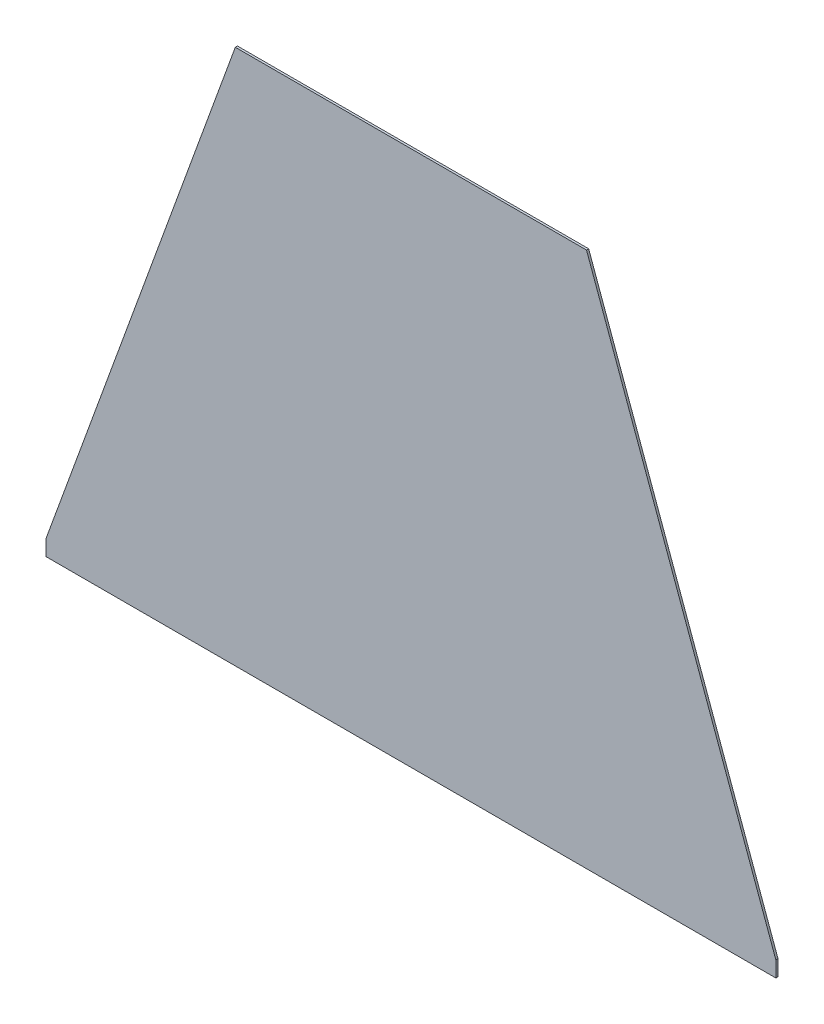
ISO-10303-21;
HEADER;
FILE_DESCRIPTION(('STEP AP214'),'2;1');
FILE_NAME('part.step','',(''),(''),'','','');
FILE_SCHEMA(('AUTOMOTIVE_DESIGN { 1 0 10303 214 1 1 1 1 }'));
ENDSEC;
DATA;
#1=APPLICATION_CONTEXT('core data for automotive mechanical design processes');
#2=APPLICATION_PROTOCOL_DEFINITION('international standard','automotive_design',2000,#1);
#3=PRODUCT_CONTEXT('',#1,'mechanical');
#4=PRODUCT('Part','Part','',(#3));
#5=PRODUCT_RELATED_PRODUCT_CATEGORY('part','',(#4));
#6=PRODUCT_DEFINITION_FORMATION('','',#4);
#7=PRODUCT_DEFINITION_CONTEXT('part definition',#1,'design');
#8=PRODUCT_DEFINITION('design','',#6,#7);
#9=PRODUCT_DEFINITION_SHAPE('','',#8);
#10=(LENGTH_UNIT() NAMED_UNIT(*) SI_UNIT(.MILLI.,.METRE.));
#11=(NAMED_UNIT(*) PLANE_ANGLE_UNIT() SI_UNIT($,.RADIAN.));
#12=(NAMED_UNIT(*) SI_UNIT($,.STERADIAN.) SOLID_ANGLE_UNIT());
#13=UNCERTAINTY_MEASURE_WITH_UNIT(LENGTH_MEASURE(1.E-05),#10,'distance_accuracy_value','');
#14=(GEOMETRIC_REPRESENTATION_CONTEXT(3) GLOBAL_UNCERTAINTY_ASSIGNED_CONTEXT((#13)) GLOBAL_UNIT_ASSIGNED_CONTEXT((#10,
#11,#12)) REPRESENTATION_CONTEXT('',''));
#15=CARTESIAN_POINT('',(0.,0.,0.));
#16=DIRECTION('',(0.,0.,1.));
#17=DIRECTION('',(1.,0.,0.));
#18=AXIS2_PLACEMENT_3D('',#15,#16,#17);
#19=CARTESIAN_POINT('',(0.,0.,1.9));
#20=DIRECTION('',(0.939692620785909,-0.342020143325666,0.));
#21=DIRECTION('',(0.342020143325666,0.93969262078591,0.));
#22=AXIS2_PLACEMENT_3D('',#19,#20,#21);
#23=PLANE('',#22);
#24=DIRECTION('',(-0.342020143325666,-0.93969262078591,0.));
#25=VECTOR('',#24,1.);
#26=CARTESIAN_POINT('',(0.,0.,0.));
#27=LINE('',#26,#25);
#28=CARTESIAN_POINT('',(171.010071662833,469.846310392955,0.));
#29=VERTEX_POINT('',#28);
#30=CARTESIAN_POINT('',(5.,13.7373870972733,0.));
#31=VERTEX_POINT('',#30);
#32=EDGE_CURVE('E114',#29,#31,#27,.T.);
#33=ORIENTED_EDGE('',*,*,#32,.T.);
#34=DIRECTION('',(0.,0.,1.));
#35=VECTOR('',#34,1.);
#36=CARTESIAN_POINT('',(5.,13.7373870972733,1.9));
#37=LINE('',#36,#35);
#38=CARTESIAN_POINT('',(5.,13.7373870972733,1.9));
#39=VERTEX_POINT('',#38);
#40=EDGE_CURVE('E50',#31,#39,#37,.T.);
#41=ORIENTED_EDGE('',*,*,#40,.T.);
#42=DIRECTION('',(-0.342020143325666,-0.93969262078591,0.));
#43=VECTOR('',#42,1.);
#44=CARTESIAN_POINT('',(0.,0.,1.9));
#45=LINE('',#44,#43);
#46=CARTESIAN_POINT('',(171.010071662833,469.846310392955,1.9));
#47=VERTEX_POINT('',#46);
#48=EDGE_CURVE('E100',#47,#39,#45,.T.);
#49=ORIENTED_EDGE('',*,*,#48,.F.);
#50=DIRECTION('',(0.,0.,-1.));
#51=VECTOR('',#50,1.);
#52=CARTESIAN_POINT('',(171.010071662833,469.846310392955,1.9));
#53=LINE('',#52,#51);
#54=EDGE_CURVE('E113',#47,#29,#53,.T.);
#55=ORIENTED_EDGE('',*,*,#54,.T.);
#56=EDGE_LOOP('',(#33,#41,#49,#55));
#57=FACE_BOUND('',#56,.T.);
#58=ADVANCED_FACE('F37',(#57),#23,.F.);
#59=CARTESIAN_POINT('',(0.,0.,1.9));
#60=DIRECTION('',(0.,1.,0.));
#61=DIRECTION('',(0.,0.,1.));
#62=AXIS2_PLACEMENT_3D('',#59,#60,#61);
#63=PLANE('',#62);
#64=DIRECTION('',(1.,0.,0.));
#65=VECTOR('',#64,1.);
#66=CARTESIAN_POINT('',(0.,0.,1.9));
#67=LINE('',#66,#65);
#68=CARTESIAN_POINT('',(5.,0.,1.9));
#69=VERTEX_POINT('',#68);
#70=CARTESIAN_POINT('',(645.,0.,1.9));
#71=VERTEX_POINT('',#70);
#72=EDGE_CURVE('E97',#69,#71,#67,.T.);
#73=ORIENTED_EDGE('',*,*,#72,.F.);
#74=DIRECTION('',(0.,0.,1.));
#75=VECTOR('',#74,1.);
#76=CARTESIAN_POINT('',(5.,0.,-8.1));
#77=LINE('',#76,#75);
#78=CARTESIAN_POINT('',(5.,0.,0.));
#79=VERTEX_POINT('',#78);
#80=EDGE_CURVE('E87',#79,#69,#77,.T.);
#81=ORIENTED_EDGE('',*,*,#80,.F.);
#82=DIRECTION('',(1.,0.,0.));
#83=VECTOR('',#82,1.);
#84=CARTESIAN_POINT('',(0.,0.,0.));
#85=LINE('',#84,#83);
#86=CARTESIAN_POINT('',(645.,0.,0.));
#87=VERTEX_POINT('',#86);
#88=EDGE_CURVE('E58',#79,#87,#85,.T.);
#89=ORIENTED_EDGE('',*,*,#88,.T.);
#90=DIRECTION('',(0.,0.,1.));
#91=VECTOR('',#90,1.);
#92=CARTESIAN_POINT('',(645.,0.,-8.1));
#93=LINE('',#92,#91);
#94=EDGE_CURVE('E103',#87,#71,#93,.T.);
#95=ORIENTED_EDGE('',*,*,#94,.T.);
#96=EDGE_LOOP('',(#73,#81,#89,#95));
#97=FACE_BOUND('',#96,.T.);
#98=ADVANCED_FACE('F102',(#97),#63,.F.);
#99=CARTESIAN_POINT('',(650.,0.,1.9));
#100=DIRECTION('',(-0.939692620785907,-0.342020143325673,0.));
#101=DIRECTION('',(0.342020143325673,-0.939692620785907,0.));
#102=AXIS2_PLACEMENT_3D('',#99,#100,#101);
#103=PLANE('',#102);
#104=DIRECTION('',(-0.342020143325673,0.939692620785907,0.));
#105=VECTOR('',#104,1.);
#106=CARTESIAN_POINT('',(650.,0.,1.9));
#107=LINE('',#106,#105);
#108=CARTESIAN_POINT('',(645.,13.7373870972729,1.9));
#109=VERTEX_POINT('',#108);
#110=CARTESIAN_POINT('',(478.989928337163,469.846310392955,1.9));
#111=VERTEX_POINT('',#110);
#112=EDGE_CURVE('E104',#109,#111,#107,.T.);
#113=ORIENTED_EDGE('',*,*,#112,.F.);
#114=DIRECTION('',(0.,0.,-1.));
#115=VECTOR('',#114,1.);
#116=CARTESIAN_POINT('',(645.,13.7373870972729,1.9));
#117=LINE('',#116,#115);
#118=CARTESIAN_POINT('',(645.,13.7373870972729,0.));
#119=VERTEX_POINT('',#118);
#120=EDGE_CURVE('E117',#109,#119,#117,.T.);
#121=ORIENTED_EDGE('',*,*,#120,.T.);
#122=DIRECTION('',(-0.342020143325673,0.939692620785907,0.));
#123=VECTOR('',#122,1.);
#124=CARTESIAN_POINT('',(650.,0.,0.));
#125=LINE('',#124,#123);
#126=CARTESIAN_POINT('',(478.989928337163,469.846310392955,0.));
#127=VERTEX_POINT('',#126);
#128=EDGE_CURVE('E119',#119,#127,#125,.T.);
#129=ORIENTED_EDGE('',*,*,#128,.T.);
#130=DIRECTION('',(0.,0.,-1.));
#131=VECTOR('',#130,1.);
#132=CARTESIAN_POINT('',(478.989928337163,469.846310392955,1.9));
#133=LINE('',#132,#131);
#134=EDGE_CURVE('E124',#111,#127,#133,.T.);
#135=ORIENTED_EDGE('',*,*,#134,.F.);
#136=EDGE_LOOP('',(#113,#121,#129,#135));
#137=FACE_BOUND('',#136,.T.);
#138=ADVANCED_FACE('F134',(#137),#103,.F.);
#139=CARTESIAN_POINT('',(171.010071662833,469.846310392955,1.9));
#140=DIRECTION('',(0.,-1.,0.));
#141=DIRECTION('',(0.,0.,-1.));
#142=AXIS2_PLACEMENT_3D('',#139,#140,#141);
#143=PLANE('',#142);
#144=DIRECTION('',(-1.,0.,0.));
#145=VECTOR('',#144,1.);
#146=CARTESIAN_POINT('',(171.010071662833,469.846310392955,0.));
#147=LINE('',#146,#145);
#148=EDGE_CURVE('E108',#127,#29,#147,.T.);
#149=ORIENTED_EDGE('',*,*,#148,.T.);
#150=ORIENTED_EDGE('',*,*,#54,.F.);
#151=DIRECTION('',(-1.,0.,0.));
#152=VECTOR('',#151,1.);
#153=CARTESIAN_POINT('',(171.010071662833,469.846310392955,1.9));
#154=LINE('',#153,#152);
#155=EDGE_CURVE('E106',#111,#47,#154,.T.);
#156=ORIENTED_EDGE('',*,*,#155,.F.);
#157=ORIENTED_EDGE('',*,*,#134,.T.);
#158=EDGE_LOOP('',(#149,#150,#156,#157));
#159=FACE_BOUND('',#158,.T.);
#160=ADVANCED_FACE('F141',(#159),#143,.F.);
#161=CARTESIAN_POINT('',(0.,0.,1.9));
#162=DIRECTION('',(0.,0.,-1.));
#163=DIRECTION('',(-1.,0.,0.));
#164=AXIS2_PLACEMENT_3D('',#161,#162,#163);
#165=PLANE('',#164);
#166=ORIENTED_EDGE('',*,*,#48,.T.);
#167=DIRECTION('',(0.,1.,0.));
#168=VECTOR('',#167,1.);
#169=CARTESIAN_POINT('',(5.,0.,1.9));
#170=LINE('',#169,#168);
#171=EDGE_CURVE('E90',#69,#39,#170,.T.);
#172=ORIENTED_EDGE('',*,*,#171,.F.);
#173=ORIENTED_EDGE('',*,*,#72,.T.);
#174=DIRECTION('',(0.,-1.,0.));
#175=VECTOR('',#174,1.);
#176=CARTESIAN_POINT('',(645.,0.,1.9));
#177=LINE('',#176,#175);
#178=EDGE_CURVE('E144',#109,#71,#177,.T.);
#179=ORIENTED_EDGE('',*,*,#178,.F.);
#180=ORIENTED_EDGE('',*,*,#112,.T.);
#181=ORIENTED_EDGE('',*,*,#155,.T.);
#182=EDGE_LOOP('',(#166,#172,#173,#179,#180,#181));
#183=FACE_BOUND('',#182,.T.);
#184=ADVANCED_FACE('F95',(#183),#165,.F.);
#185=CARTESIAN_POINT('',(0.,0.,0.));
#186=DIRECTION('',(0.,0.,-1.));
#187=DIRECTION('',(-1.,0.,0.));
#188=AXIS2_PLACEMENT_3D('',#185,#186,#187);
#189=PLANE('',#188);
#190=DIRECTION('',(0.,-1.,0.));
#191=VECTOR('',#190,1.);
#192=CARTESIAN_POINT('',(5.,0.,0.));
#193=LINE('',#192,#191);
#194=EDGE_CURVE('E11',#31,#79,#193,.T.);
#195=ORIENTED_EDGE('',*,*,#194,.F.);
#196=ORIENTED_EDGE('',*,*,#32,.F.);
#197=ORIENTED_EDGE('',*,*,#148,.F.);
#198=ORIENTED_EDGE('',*,*,#128,.F.);
#199=DIRECTION('',(0.,1.,0.));
#200=VECTOR('',#199,1.);
#201=CARTESIAN_POINT('',(645.,0.,0.));
#202=LINE('',#201,#200);
#203=EDGE_CURVE('E44',#87,#119,#202,.T.);
#204=ORIENTED_EDGE('',*,*,#203,.F.);
#205=ORIENTED_EDGE('',*,*,#88,.F.);
#206=EDGE_LOOP('',(#195,#196,#197,#198,#204,#205));
#207=FACE_BOUND('',#206,.T.);
#208=ADVANCED_FACE('F137',(#207),#189,.T.);
#209=CARTESIAN_POINT('',(645.,0.,-8.1));
#210=DIRECTION('',(-1.,0.,0.));
#211=DIRECTION('',(0.,0.,1.));
#212=AXIS2_PLACEMENT_3D('',#209,#210,#211);
#213=PLANE('',#212);
#214=ORIENTED_EDGE('',*,*,#178,.T.);
#215=ORIENTED_EDGE('',*,*,#94,.F.);
#216=ORIENTED_EDGE('',*,*,#203,.T.);
#217=ORIENTED_EDGE('',*,*,#120,.F.);
#218=EDGE_LOOP('',(#214,#215,#216,#217));
#219=FACE_BOUND('',#218,.T.);
#220=ADVANCED_FACE('F129',(#219),#213,.F.);
#221=CARTESIAN_POINT('',(5.,0.,-8.1));
#222=DIRECTION('',(1.,0.,0.));
#223=DIRECTION('',(0.,0.,-1.));
#224=AXIS2_PLACEMENT_3D('',#221,#222,#223);
#225=PLANE('',#224);
#226=ORIENTED_EDGE('',*,*,#194,.T.);
#227=ORIENTED_EDGE('',*,*,#80,.T.);
#228=ORIENTED_EDGE('',*,*,#171,.T.);
#229=ORIENTED_EDGE('',*,*,#40,.F.);
#230=EDGE_LOOP('',(#226,#227,#228,#229));
#231=FACE_BOUND('',#230,.T.);
#232=ADVANCED_FACE('F89',(#231),#225,.F.);
#233=CLOSED_SHELL('',(#58,#98,#138,#160,#184,#208,#220,#232));
#234=MANIFOLD_SOLID_BREP('B2',#233);
#235=ADVANCED_BREP_SHAPE_REPRESENTATION('',(#18,#234),#14);
#236=SHAPE_DEFINITION_REPRESENTATION(#9,#235);
ENDSEC;
END-ISO-10303-21;
